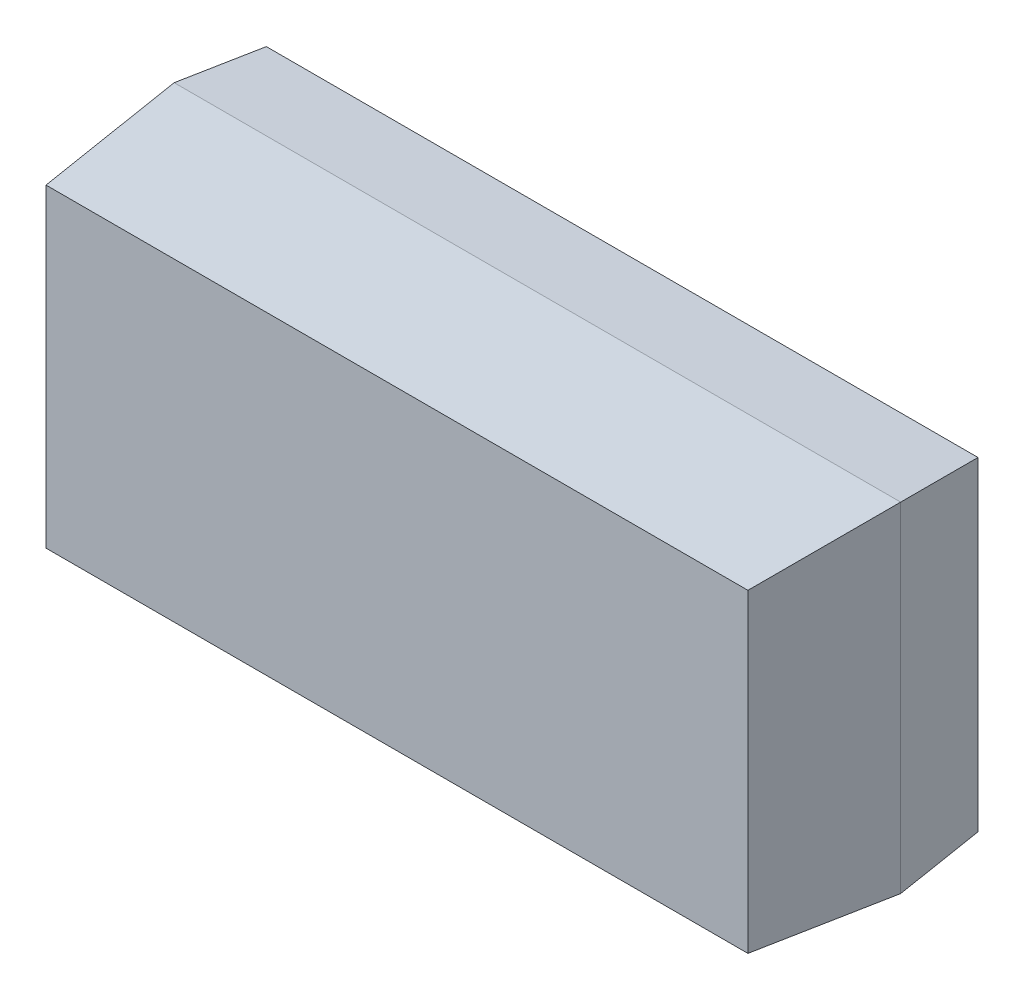
ISO-10303-21;
HEADER;
FILE_DESCRIPTION(('STEP AP214'),'2;1');
FILE_NAME('part.step','',(''),(''),'','','');
FILE_SCHEMA(('AUTOMOTIVE_DESIGN { 1 0 10303 214 1 1 1 1 }'));
ENDSEC;
DATA;
#1=APPLICATION_CONTEXT('core data for automotive mechanical design processes');
#2=APPLICATION_PROTOCOL_DEFINITION('international standard','automotive_design',2000,#1);
#3=PRODUCT_CONTEXT('',#1,'mechanical');
#4=PRODUCT('Part','Part','',(#3));
#5=PRODUCT_RELATED_PRODUCT_CATEGORY('part','',(#4));
#6=PRODUCT_DEFINITION_FORMATION('','',#4);
#7=PRODUCT_DEFINITION_CONTEXT('part definition',#1,'design');
#8=PRODUCT_DEFINITION('design','',#6,#7);
#9=PRODUCT_DEFINITION_SHAPE('','',#8);
#10=(LENGTH_UNIT() NAMED_UNIT(*) SI_UNIT(.MILLI.,.METRE.));
#11=(NAMED_UNIT(*) PLANE_ANGLE_UNIT() SI_UNIT($,.RADIAN.));
#12=(NAMED_UNIT(*) SI_UNIT($,.STERADIAN.) SOLID_ANGLE_UNIT());
#13=UNCERTAINTY_MEASURE_WITH_UNIT(LENGTH_MEASURE(1.E-05),#10,'distance_accuracy_value','');
#14=(GEOMETRIC_REPRESENTATION_CONTEXT(3) GLOBAL_UNCERTAINTY_ASSIGNED_CONTEXT((#13)) GLOBAL_UNIT_ASSIGNED_CONTEXT((#10,
#11,#12)) REPRESENTATION_CONTEXT('',''));
#15=CARTESIAN_POINT('',(0.,0.,0.));
#16=DIRECTION('',(0.,0.,1.));
#17=DIRECTION('',(1.,0.,0.));
#18=AXIS2_PLACEMENT_3D('',#15,#16,#17);
#19=CARTESIAN_POINT('',(-0.611778730424644,-0.477301685692797,0.109451736155931));
#20=DIRECTION('',(0.,0.,-1.));
#21=DIRECTION('',(0.,1.,0.));
#22=AXIS2_PLACEMENT_3D('',#19,#20,#21);
#23=PLANE('',#22);
#24=DIRECTION('',(0.,1.,0.));
#25=VECTOR('',#24,1.);
#26=CARTESIAN_POINT('',(-0.491958304919706,-0.418869314327818,0.109451736155931));
#27=LINE('',#26,#25);
#28=CARTESIAN_POINT('',(-0.491958304919706,-0.474745557444155,0.109451736155931));
#29=VERTEX_POINT('',#28);
#30=CARTESIAN_POINT('',(-0.491958304919706,-0.423622992471322,0.109451736155931));
#31=VERTEX_POINT('',#30);
#32=EDGE_CURVE('E89',#29,#31,#27,.T.);
#33=ORIENTED_EDGE('',*,*,#32,.T.);
#34=DIRECTION('',(1.,0.,0.));
#35=VECTOR('',#34,1.);
#36=CARTESIAN_POINT('',(-0.613976280319508,-0.423622992471322,0.109451736155931));
#37=LINE('',#36,#35);
#38=CARTESIAN_POINT('',(-0.60607299587679,-0.423622992471322,0.109451736155931));
#39=VERTEX_POINT('',#38);
#40=EDGE_CURVE('E71',#31,#39,#37,.F.);
#41=ORIENTED_EDGE('',*,*,#40,.T.);
#42=DIRECTION('',(0.,1.,0.));
#43=VECTOR('',#42,1.);
#44=CARTESIAN_POINT('',(-0.60607299587679,-0.418869314327818,0.109451736155931));
#45=LINE('',#44,#43);
#46=CARTESIAN_POINT('',(-0.60607299587679,-0.474745557444155,0.109451736155931));
#47=VERTEX_POINT('',#46);
#48=EDGE_CURVE('E20',#39,#47,#45,.F.);
#49=ORIENTED_EDGE('',*,*,#48,.T.);
#50=DIRECTION('',(1.,0.,0.));
#51=VECTOR('',#50,1.);
#52=CARTESIAN_POINT('',(-0.613976280319508,-0.474745557444155,0.109451736155931));
#53=LINE('',#52,#51);
#54=EDGE_CURVE('E67',#47,#29,#53,.T.);
#55=ORIENTED_EDGE('',*,*,#54,.T.);
#56=EDGE_LOOP('',(#33,#41,#49,#55));
#57=FACE_BOUND('',#56,.T.);
#58=ADVANCED_FACE('F17',(#57),#23,.F.);
#59=CARTESIAN_POINT('',(-0.608170657140069,-0.418869314327818,0.0854753582031754));
#60=DIRECTION('',(0.996194698091746,0.,-0.0871557427476491));
#61=DIRECTION('',(-0.0871557427476491,0.,-0.996194698091746));
#62=AXIS2_PLACEMENT_3D('',#59,#60,#61);
#63=PLANE('',#62);
#64=DIRECTION('',(0.0868265938642338,0.0868265938642409,0.992432509138969));
#65=VECTOR('',#64,1.);
#66=CARTESIAN_POINT('',(-0.608070768508484,-0.476743330075849,0.08661709048664));
#67=LINE('',#66,#65);
#68=CARTESIAN_POINT('',(-0.608070768508484,-0.476743330075849,0.08661709048664));
#69=VERTEX_POINT('',#68);
#70=EDGE_CURVE('E76',#69,#47,#67,.T.);
#71=ORIENTED_EDGE('',*,*,#70,.T.);
#72=ORIENTED_EDGE('',*,*,#48,.F.);
#73=DIRECTION('',(-0.0868265938642342,0.0868265938642012,-0.992432509138973));
#74=VECTOR('',#73,1.);
#75=CARTESIAN_POINT('',(-0.60607299587679,-0.423622992471322,0.109451736155931));
#76=LINE('',#75,#74);
#77=CARTESIAN_POINT('',(-0.608070768508484,-0.421625219839629,0.08661709048664));
#78=VERTEX_POINT('',#77);
#79=EDGE_CURVE('E91',#39,#78,#76,.T.);
#80=ORIENTED_EDGE('',*,*,#79,.T.);
#81=DIRECTION('',(0.,1.,0.));
#82=VECTOR('',#81,1.);
#83=CARTESIAN_POINT('',(-0.608070768508484,-0.418869314327818,0.08661709048664));
#84=LINE('',#83,#82);
#85=EDGE_CURVE('E85',#78,#69,#84,.F.);
#86=ORIENTED_EDGE('',*,*,#85,.T.);
#87=EDGE_LOOP('',(#71,#72,#80,#86));
#88=FACE_BOUND('',#87,.T.);
#89=ADVANCED_FACE('F84',(#88),#63,.F.);
#90=CARTESIAN_POINT('',(-0.613976280319508,-0.476843218707434,0.0854753582031754));
#91=DIRECTION('',(0.,0.996194698091746,-0.087155742747651));
#92=DIRECTION('',(0.,0.087155742747651,0.996194698091746));
#93=AXIS2_PLACEMENT_3D('',#90,#91,#92);
#94=PLANE('',#93);
#95=DIRECTION('',(-0.0868265938642432,0.0868265938642385,0.992432509138968));
#96=VECTOR('',#95,1.);
#97=CARTESIAN_POINT('',(-0.489960532288012,-0.476743330075849,0.08661709048664));
#98=LINE('',#97,#96);
#99=CARTESIAN_POINT('',(-0.489960532288012,-0.476743330075849,0.08661709048664));
#100=VERTEX_POINT('',#99);
#101=EDGE_CURVE('E82',#100,#29,#98,.T.);
#102=ORIENTED_EDGE('',*,*,#101,.T.);
#103=ORIENTED_EDGE('',*,*,#54,.F.);
#104=ORIENTED_EDGE('',*,*,#70,.F.);
#105=DIRECTION('',(1.,0.,0.));
#106=VECTOR('',#105,1.);
#107=CARTESIAN_POINT('',(-0.613976280319508,-0.476743330075849,0.08661709048664));
#108=LINE('',#107,#106);
#109=EDGE_CURVE('E101',#69,#100,#108,.T.);
#110=ORIENTED_EDGE('',*,*,#109,.T.);
#111=EDGE_LOOP('',(#102,#103,#104,#110));
#112=FACE_BOUND('',#111,.T.);
#113=ADVANCED_FACE('F79',(#112),#94,.F.);
#114=CARTESIAN_POINT('',(-0.492058193551291,-0.418869314327818,0.110593468439396));
#115=DIRECTION('',(-0.996194698091746,0.,-0.0871557427476518));
#116=DIRECTION('',(-0.0871557427476518,0.,0.996194698091746));
#117=AXIS2_PLACEMENT_3D('',#114,#115,#116);
#118=PLANE('',#117);
#119=ORIENTED_EDGE('',*,*,#101,.F.);
#120=DIRECTION('',(0.,1.,0.));
#121=VECTOR('',#120,1.);
#122=CARTESIAN_POINT('',(-0.489960532288012,-0.418869314327818,0.08661709048664));
#123=LINE('',#122,#121);
#124=CARTESIAN_POINT('',(-0.489960532288012,-0.421625219839629,0.08661709048664));
#125=VERTEX_POINT('',#124);
#126=EDGE_CURVE('E106',#100,#125,#123,.T.);
#127=ORIENTED_EDGE('',*,*,#126,.T.);
#128=DIRECTION('',(-0.0868265938642342,-0.0868265938642012,0.992432509138973));
#129=VECTOR('',#128,1.);
#130=CARTESIAN_POINT('',(-0.489960532288012,-0.421625219839629,0.08661709048664));
#131=LINE('',#130,#129);
#132=EDGE_CURVE('E93',#125,#31,#131,.T.);
#133=ORIENTED_EDGE('',*,*,#132,.T.);
#134=ORIENTED_EDGE('',*,*,#32,.F.);
#135=EDGE_LOOP('',(#119,#127,#133,#134));
#136=FACE_BOUND('',#135,.T.);
#137=ADVANCED_FACE('F153',(#136),#118,.F.);
#138=CARTESIAN_POINT('',(-0.613976280319508,-0.423722881102907,0.110593468439396));
#139=DIRECTION('',(0.,-0.99619469809175,-0.0871557427476112));
#140=DIRECTION('',(0.,0.0871557427476112,-0.99619469809175));
#141=AXIS2_PLACEMENT_3D('',#138,#139,#140);
#142=PLANE('',#141);
#143=ORIENTED_EDGE('',*,*,#132,.F.);
#144=DIRECTION('',(1.,0.,0.));
#145=VECTOR('',#144,1.);
#146=CARTESIAN_POINT('',(-0.613976280319508,-0.421625219839629,0.08661709048664));
#147=LINE('',#146,#145);
#148=EDGE_CURVE('E113',#125,#78,#147,.F.);
#149=ORIENTED_EDGE('',*,*,#148,.T.);
#150=ORIENTED_EDGE('',*,*,#79,.F.);
#151=ORIENTED_EDGE('',*,*,#40,.F.);
#152=EDGE_LOOP('',(#143,#149,#150,#151));
#153=FACE_BOUND('',#152,.T.);
#154=ADVANCED_FACE('F150',(#153),#142,.F.);
#155=CARTESIAN_POINT('',(-0.606804938435816,-0.418869314327818,0.072148586549632));
#156=DIRECTION('',(0.996194698091747,0.,0.0871557427476422));
#157=DIRECTION('',(0.0871557427476422,0.,-0.996194698091747));
#158=AXIS2_PLACEMENT_3D('',#155,#156,#157);
#159=PLANE('',#158);
#160=DIRECTION('',(-0.0868265938642169,-0.0868265938642404,0.99243250913897));
#161=VECTOR('',#160,1.);
#162=CARTESIAN_POINT('',(-0.606865216058324,-0.475537777625689,0.0728375629275848));
#163=LINE('',#162,#161);
#164=CARTESIAN_POINT('',(-0.606865216058324,-0.475537777625689,0.0728375629275848));
#165=VERTEX_POINT('',#164);
#166=EDGE_CURVE('E98',#165,#69,#163,.T.);
#167=ORIENTED_EDGE('',*,*,#166,.T.);
#168=ORIENTED_EDGE('',*,*,#85,.F.);
#169=DIRECTION('',(0.0868265938642164,-0.0868265938643101,-0.992432509138964));
#170=VECTOR('',#169,1.);
#171=CARTESIAN_POINT('',(-0.608070768508484,-0.421625219839629,0.08661709048664));
#172=LINE('',#171,#170);
#173=CARTESIAN_POINT('',(-0.606865216058324,-0.42283077228979,0.0728375629275848));
#174=VERTEX_POINT('',#173);
#175=EDGE_CURVE('E109',#78,#174,#172,.T.);
#176=ORIENTED_EDGE('',*,*,#175,.T.);
#177=DIRECTION('',(0.,-1.,0.));
#178=VECTOR('',#177,1.);
#179=CARTESIAN_POINT('',(-0.606865216058324,-0.420195422022995,0.0728375629275848));
#180=LINE('',#179,#178);
#181=EDGE_CURVE('E116',#174,#165,#180,.T.);
#182=ORIENTED_EDGE('',*,*,#181,.T.);
#183=EDGE_LOOP('',(#167,#168,#176,#182));
#184=FACE_BOUND('',#183,.T.);
#185=ADVANCED_FACE('F133',(#184),#159,.F.);
#186=CARTESIAN_POINT('',(-0.613976280319508,-0.475477500003181,0.072148586549632));
#187=DIRECTION('',(0.,0.996194698091746,0.0871557427476517));
#188=DIRECTION('',(0.,-0.0871557427476517,0.996194698091746));
#189=AXIS2_PLACEMENT_3D('',#186,#187,#188);
#190=PLANE('',#189);
#191=ORIENTED_EDGE('',*,*,#166,.F.);
#192=DIRECTION('',(1.,0.,0.));
#193=VECTOR('',#192,1.);
#194=CARTESIAN_POINT('',(-0.612650172624332,-0.475537777625689,0.0728375629275848));
#195=LINE('',#194,#193);
#196=CARTESIAN_POINT('',(-0.491166084738172,-0.475537777625689,0.0728375629275848));
#197=VERTEX_POINT('',#196);
#198=EDGE_CURVE('E119',#165,#197,#195,.T.);
#199=ORIENTED_EDGE('',*,*,#198,.T.);
#200=DIRECTION('',(0.0868265938642324,-0.0868265938642246,0.99243250913897));
#201=VECTOR('',#200,1.);
#202=CARTESIAN_POINT('',(-0.491166084738172,-0.475537777625689,0.0728375629275848));
#203=LINE('',#202,#201);
#204=EDGE_CURVE('E103',#197,#100,#203,.T.);
#205=ORIENTED_EDGE('',*,*,#204,.T.);
#206=ORIENTED_EDGE('',*,*,#109,.F.);
#207=EDGE_LOOP('',(#191,#199,#205,#206));
#208=FACE_BOUND('',#207,.T.);
#209=ADVANCED_FACE('F131',(#208),#190,.F.);
#210=CARTESIAN_POINT('',(-0.489900254665504,-0.418869314327818,0.0873060668645927));
#211=DIRECTION('',(-0.996194698091747,0.,0.0871557427476418));
#212=DIRECTION('',(0.0871557427476418,0.,0.996194698091747));
#213=AXIS2_PLACEMENT_3D('',#210,#211,#212);
#214=PLANE('',#213);
#215=ORIENTED_EDGE('',*,*,#204,.F.);
#216=DIRECTION('',(0.,-1.,0.));
#217=VECTOR('',#216,1.);
#218=CARTESIAN_POINT('',(-0.491166084738172,-0.420195422022995,0.0728375629275848));
#219=LINE('',#218,#217);
#220=CARTESIAN_POINT('',(-0.491166084738172,-0.42283077228979,0.0728375629275848));
#221=VERTEX_POINT('',#220);
#222=EDGE_CURVE('E26',#197,#221,#219,.F.);
#223=ORIENTED_EDGE('',*,*,#222,.T.);
#224=DIRECTION('',(0.0868265938642163,0.08682659386431,0.992432509138964));
#225=VECTOR('',#224,1.);
#226=CARTESIAN_POINT('',(-0.491166084738172,-0.42283077228979,0.0728375629275848));
#227=LINE('',#226,#225);
#228=EDGE_CURVE('E34',#221,#125,#227,.T.);
#229=ORIENTED_EDGE('',*,*,#228,.T.);
#230=ORIENTED_EDGE('',*,*,#126,.F.);
#231=EDGE_LOOP('',(#215,#223,#229,#230));
#232=FACE_BOUND('',#231,.T.);
#233=ADVANCED_FACE('F125',(#232),#214,.F.);
#234=CARTESIAN_POINT('',(-0.613976280319508,-0.421564942217121,0.0873060668645927));
#235=DIRECTION('',(0.,-0.99619469809174,0.0871557427477216));
#236=DIRECTION('',(0.,-0.0871557427477216,-0.99619469809174));
#237=AXIS2_PLACEMENT_3D('',#234,#235,#236);
#238=PLANE('',#237);
#239=ORIENTED_EDGE('',*,*,#228,.F.);
#240=DIRECTION('',(1.,0.,0.));
#241=VECTOR('',#240,1.);
#242=CARTESIAN_POINT('',(-0.612650172624332,-0.42283077228979,0.0728375629275848));
#243=LINE('',#242,#241);
#244=EDGE_CURVE('E11',#221,#174,#243,.F.);
#245=ORIENTED_EDGE('',*,*,#244,.T.);
#246=ORIENTED_EDGE('',*,*,#175,.F.);
#247=ORIENTED_EDGE('',*,*,#148,.F.);
#248=EDGE_LOOP('',(#239,#245,#246,#247));
#249=FACE_BOUND('',#248,.T.);
#250=ADVANCED_FACE('F135',(#249),#238,.F.);
#251=CARTESIAN_POINT('',(-0.612650172624332,-0.420195422022995,0.0728375629275848));
#252=DIRECTION('',(0.,0.,1.));
#253=DIRECTION('',(0.,-1.,0.));
#254=AXIS2_PLACEMENT_3D('',#251,#252,#253);
#255=PLANE('',#254);
#256=ORIENTED_EDGE('',*,*,#222,.F.);
#257=ORIENTED_EDGE('',*,*,#198,.F.);
#258=ORIENTED_EDGE('',*,*,#181,.F.);
#259=ORIENTED_EDGE('',*,*,#244,.F.);
#260=EDGE_LOOP('',(#256,#257,#258,#259));
#261=FACE_BOUND('',#260,.T.);
#262=ADVANCED_FACE('F129',(#261),#255,.F.);
#263=CLOSED_SHELL('',(#58,#89,#113,#137,#154,#185,#209,#233,#250,#262));
#264=MANIFOLD_SOLID_BREP('B1',#263);
#265=ADVANCED_BREP_SHAPE_REPRESENTATION('',(#18,#264),#14);
#266=SHAPE_DEFINITION_REPRESENTATION(#9,#265);
ENDSEC;
END-ISO-10303-21;
